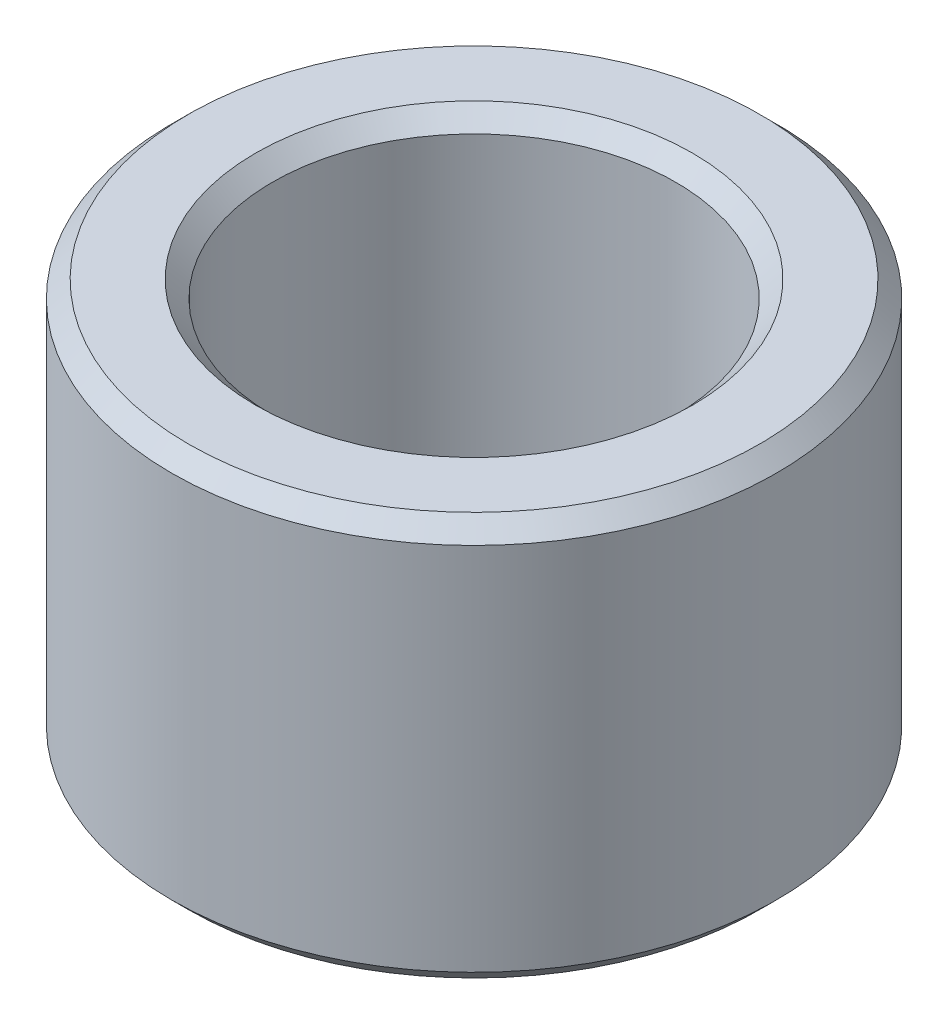
ISO-10303-21;
HEADER;
FILE_DESCRIPTION(('STEP AP214'),'2;1');
FILE_NAME('part.step','',(''),(''),'','','');
FILE_SCHEMA(('AUTOMOTIVE_DESIGN { 1 0 10303 214 1 1 1 1 }'));
ENDSEC;
DATA;
#1=APPLICATION_CONTEXT('core data for automotive mechanical design processes');
#2=APPLICATION_PROTOCOL_DEFINITION('international standard','automotive_design',2000,#1);
#3=PRODUCT_CONTEXT('',#1,'mechanical');
#4=PRODUCT('Part','Part','',(#3));
#5=PRODUCT_RELATED_PRODUCT_CATEGORY('part','',(#4));
#6=PRODUCT_DEFINITION_FORMATION('','',#4);
#7=PRODUCT_DEFINITION_CONTEXT('part definition',#1,'design');
#8=PRODUCT_DEFINITION('design','',#6,#7);
#9=PRODUCT_DEFINITION_SHAPE('','',#8);
#10=(LENGTH_UNIT() NAMED_UNIT(*) SI_UNIT(.MILLI.,.METRE.));
#11=(NAMED_UNIT(*) PLANE_ANGLE_UNIT() SI_UNIT($,.RADIAN.));
#12=(NAMED_UNIT(*) SI_UNIT($,.STERADIAN.) SOLID_ANGLE_UNIT());
#13=UNCERTAINTY_MEASURE_WITH_UNIT(LENGTH_MEASURE(1.E-05),#10,'distance_accuracy_value','');
#14=(GEOMETRIC_REPRESENTATION_CONTEXT(3) GLOBAL_UNCERTAINTY_ASSIGNED_CONTEXT((#13)) GLOBAL_UNIT_ASSIGNED_CONTEXT((#10,
#11,#12)) REPRESENTATION_CONTEXT('',''));
#15=CARTESIAN_POINT('',(0.,0.,0.));
#16=DIRECTION('',(0.,0.,1.));
#17=DIRECTION('',(1.,0.,0.));
#18=AXIS2_PLACEMENT_3D('',#15,#16,#17);
#19=CARTESIAN_POINT('',(0.,12.,0.));
#20=DIRECTION('',(0.,1.,0.));
#21=DIRECTION('',(0.,0.,1.));
#22=AXIS2_PLACEMENT_3D('',#19,#20,#21);
#23=PLANE('',#22);
#24=CARTESIAN_POINT('',(0.,12.,0.));
#25=DIRECTION('',(0.,1.,0.));
#26=DIRECTION('',(0.,0.,1.));
#27=AXIS2_PLACEMENT_3D('',#24,#25,#26);
#28=CIRCLE('',#27,8.5);
#29=CARTESIAN_POINT('',(0.,12.,8.5));
#30=VERTEX_POINT('',#29);
#31=EDGE_CURVE('E10',#30,#30,#28,.T.);
#32=ORIENTED_EDGE('',*,*,#31,.T.);
#33=EDGE_LOOP('',(#32));
#34=FACE_BOUND('',#33,.T.);
#35=CARTESIAN_POINT('',(0.,12.,0.));
#36=DIRECTION('',(0.,1.,0.));
#37=DIRECTION('',(0.,0.,1.));
#38=AXIS2_PLACEMENT_3D('',#35,#36,#37);
#39=CIRCLE('',#38,6.50000000000001);
#40=CARTESIAN_POINT('',(0.,12.,6.50000000000001));
#41=VERTEX_POINT('',#40);
#42=EDGE_CURVE('E45',#41,#41,#39,.F.);
#43=ORIENTED_EDGE('',*,*,#42,.T.);
#44=EDGE_LOOP('',(#43));
#45=FACE_BOUND('',#44,.T.);
#46=ADVANCED_FACE('F37',(#34,#45),#23,.T.);
#47=CARTESIAN_POINT('',(0.,0.,0.));
#48=DIRECTION('',(0.,1.,0.));
#49=DIRECTION('',(0.,0.,1.));
#50=AXIS2_PLACEMENT_3D('',#47,#48,#49);
#51=PLANE('',#50);
#52=CARTESIAN_POINT('',(0.,0.,0.));
#53=DIRECTION('',(0.,1.,0.));
#54=DIRECTION('',(0.,0.,1.));
#55=AXIS2_PLACEMENT_3D('',#52,#53,#54);
#56=CIRCLE('',#55,8.5);
#57=CARTESIAN_POINT('',(0.,0.,8.5));
#58=VERTEX_POINT('',#57);
#59=EDGE_CURVE('E61',#58,#58,#56,.F.);
#60=ORIENTED_EDGE('',*,*,#59,.T.);
#61=EDGE_LOOP('',(#60));
#62=FACE_BOUND('',#61,.T.);
#63=CARTESIAN_POINT('',(0.,0.,0.));
#64=DIRECTION('',(0.,1.,0.));
#65=DIRECTION('',(0.,0.,1.));
#66=AXIS2_PLACEMENT_3D('',#63,#64,#65);
#67=CIRCLE('',#66,6.5);
#68=CARTESIAN_POINT('',(0.,0.,6.5));
#69=VERTEX_POINT('',#68);
#70=EDGE_CURVE('E65',#69,#69,#67,.T.);
#71=ORIENTED_EDGE('',*,*,#70,.T.);
#72=EDGE_LOOP('',(#71));
#73=FACE_BOUND('',#72,.T.);
#74=ADVANCED_FACE('F93',(#62,#73),#51,.F.);
#75=CARTESIAN_POINT('',(0.,12.,0.));
#76=DIRECTION('',(0.,-1.,0.));
#77=DIRECTION('',(0.,0.,-1.));
#78=AXIS2_PLACEMENT_3D('',#75,#76,#77);
#79=CYLINDRICAL_SURFACE('',#78,9.);
#80=CARTESIAN_POINT('',(0.,0.5,0.));
#81=DIRECTION('',(0.,1.,0.));
#82=DIRECTION('',(0.,0.,1.));
#83=AXIS2_PLACEMENT_3D('',#80,#81,#82);
#84=CIRCLE('',#83,9.);
#85=CARTESIAN_POINT('',(0.,0.5,9.));
#86=VERTEX_POINT('',#85);
#87=EDGE_CURVE('E69',#86,#86,#84,.T.);
#88=ORIENTED_EDGE('',*,*,#87,.T.);
#89=EDGE_LOOP('',(#88));
#90=FACE_BOUND('',#89,.T.);
#91=CARTESIAN_POINT('',(0.,11.5,0.));
#92=DIRECTION('',(0.,1.,0.));
#93=DIRECTION('',(0.,0.,1.));
#94=AXIS2_PLACEMENT_3D('',#91,#92,#93);
#95=CIRCLE('',#94,9.);
#96=CARTESIAN_POINT('',(0.,11.5,9.));
#97=VERTEX_POINT('',#96);
#98=EDGE_CURVE('E73',#97,#97,#95,.F.);
#99=ORIENTED_EDGE('',*,*,#98,.T.);
#100=EDGE_LOOP('',(#99));
#101=FACE_BOUND('',#100,.T.);
#102=ADVANCED_FACE('F78',(#90,#101),#79,.T.);
#103=CARTESIAN_POINT('',(0.,12.,0.));
#104=DIRECTION('',(0.,-1.,0.));
#105=DIRECTION('',(0.,0.,-1.));
#106=AXIS2_PLACEMENT_3D('',#103,#104,#105);
#107=CYLINDRICAL_SURFACE('',#106,6.);
#108=CARTESIAN_POINT('',(0.,0.500000000000002,0.));
#109=DIRECTION('',(0.,1.,0.));
#110=DIRECTION('',(0.,0.,1.));
#111=AXIS2_PLACEMENT_3D('',#108,#109,#110);
#112=CIRCLE('',#111,6.);
#113=CARTESIAN_POINT('',(0.,0.500000000000002,6.));
#114=VERTEX_POINT('',#113);
#115=EDGE_CURVE('E50',#114,#114,#112,.F.);
#116=ORIENTED_EDGE('',*,*,#115,.T.);
#117=EDGE_LOOP('',(#116));
#118=FACE_BOUND('',#117,.T.);
#119=CARTESIAN_POINT('',(0.,11.5,0.));
#120=DIRECTION('',(0.,1.,0.));
#121=DIRECTION('',(0.,0.,1.));
#122=AXIS2_PLACEMENT_3D('',#119,#120,#121);
#123=CIRCLE('',#122,6.);
#124=CARTESIAN_POINT('',(0.,11.5,6.));
#125=VERTEX_POINT('',#124);
#126=EDGE_CURVE('E55',#125,#125,#123,.T.);
#127=ORIENTED_EDGE('',*,*,#126,.T.);
#128=EDGE_LOOP('',(#127));
#129=FACE_BOUND('',#128,.T.);
#130=ADVANCED_FACE('F101',(#118,#129),#107,.F.);
#131=CARTESIAN_POINT('',(0.,0.5,0.));
#132=DIRECTION('',(0.,1.,0.));
#133=DIRECTION('',(0.,0.,1.));
#134=AXIS2_PLACEMENT_3D('',#131,#132,#133);
#135=CONICAL_SURFACE('',#134,9.,0.78539816339745);
#136=ORIENTED_EDGE('',*,*,#59,.F.);
#137=EDGE_LOOP('',(#136));
#138=FACE_BOUND('',#137,.T.);
#139=ORIENTED_EDGE('',*,*,#87,.F.);
#140=EDGE_LOOP('',(#139));
#141=FACE_BOUND('',#140,.T.);
#142=ADVANCED_FACE('F89',(#138,#141),#135,.T.);
#143=CARTESIAN_POINT('',(0.,0.,0.));
#144=DIRECTION('',(0.,-1.,0.));
#145=DIRECTION('',(0.,0.,-1.));
#146=AXIS2_PLACEMENT_3D('',#143,#144,#145);
#147=CONICAL_SURFACE('',#146,6.5,0.785398163397447);
#148=ORIENTED_EDGE('',*,*,#115,.F.);
#149=EDGE_LOOP('',(#148));
#150=FACE_BOUND('',#149,.T.);
#151=ORIENTED_EDGE('',*,*,#70,.F.);
#152=EDGE_LOOP('',(#151));
#153=FACE_BOUND('',#152,.T.);
#154=ADVANCED_FACE('F83',(#150,#153),#147,.F.);
#155=CARTESIAN_POINT('',(0.,12.,0.));
#156=DIRECTION('',(0.,-1.,0.));
#157=DIRECTION('',(0.,0.,-1.));
#158=AXIS2_PLACEMENT_3D('',#155,#156,#157);
#159=CONICAL_SURFACE('',#158,8.5,0.785398163397445);
#160=ORIENTED_EDGE('',*,*,#98,.F.);
#161=EDGE_LOOP('',(#160));
#162=FACE_BOUND('',#161,.T.);
#163=ORIENTED_EDGE('',*,*,#31,.F.);
#164=EDGE_LOOP('',(#163));
#165=FACE_BOUND('',#164,.T.);
#166=ADVANCED_FACE('F80',(#162,#165),#159,.T.);
#167=CARTESIAN_POINT('',(0.,11.5,0.));
#168=DIRECTION('',(0.,1.,0.));
#169=DIRECTION('',(0.,0.,1.));
#170=AXIS2_PLACEMENT_3D('',#167,#168,#169);
#171=CONICAL_SURFACE('',#170,6.,0.785398163397452);
#172=ORIENTED_EDGE('',*,*,#42,.F.);
#173=EDGE_LOOP('',(#172));
#174=FACE_BOUND('',#173,.T.);
#175=ORIENTED_EDGE('',*,*,#126,.F.);
#176=EDGE_LOOP('',(#175));
#177=FACE_BOUND('',#176,.T.);
#178=ADVANCED_FACE('F39',(#174,#177),#171,.F.);
#179=CLOSED_SHELL('',(#46,#74,#102,#130,#142,#154,#166,#178));
#180=MANIFOLD_SOLID_BREP('B2',#179);
#181=ADVANCED_BREP_SHAPE_REPRESENTATION('',(#18,#180),#14);
#182=SHAPE_DEFINITION_REPRESENTATION(#9,#181);
ENDSEC;
END-ISO-10303-21;
